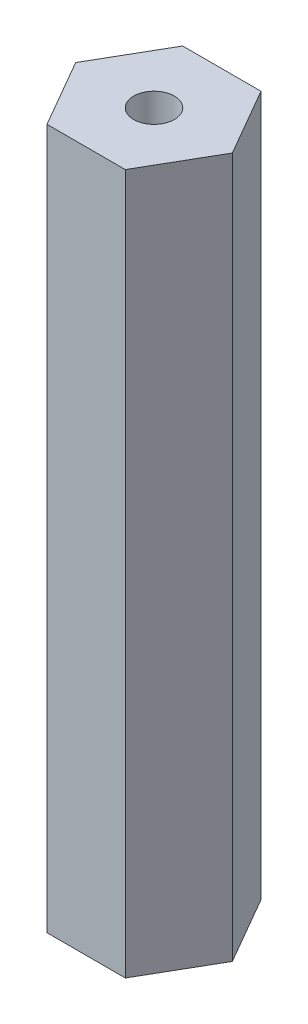
ISO-10303-21;
HEADER;
FILE_DESCRIPTION(('STEP AP214'),'2;1');
FILE_NAME('part.step','',(''),(''),'','','');
FILE_SCHEMA(('AUTOMOTIVE_DESIGN { 1 0 10303 214 1 1 1 1 }'));
ENDSEC;
DATA;
#1=APPLICATION_CONTEXT('core data for automotive mechanical design processes');
#2=APPLICATION_PROTOCOL_DEFINITION('international standard','automotive_design',2000,#1);
#3=PRODUCT_CONTEXT('',#1,'mechanical');
#4=PRODUCT('Part','Part','',(#3));
#5=PRODUCT_RELATED_PRODUCT_CATEGORY('part','',(#4));
#6=PRODUCT_DEFINITION_FORMATION('','',#4);
#7=PRODUCT_DEFINITION_CONTEXT('part definition',#1,'design');
#8=PRODUCT_DEFINITION('design','',#6,#7);
#9=PRODUCT_DEFINITION_SHAPE('','',#8);
#10=(LENGTH_UNIT() NAMED_UNIT(*) SI_UNIT(.MILLI.,.METRE.));
#11=(NAMED_UNIT(*) PLANE_ANGLE_UNIT() SI_UNIT($,.RADIAN.));
#12=(NAMED_UNIT(*) SI_UNIT($,.STERADIAN.) SOLID_ANGLE_UNIT());
#13=UNCERTAINTY_MEASURE_WITH_UNIT(LENGTH_MEASURE(1.E-05),#10,'distance_accuracy_value','');
#14=(GEOMETRIC_REPRESENTATION_CONTEXT(3) GLOBAL_UNCERTAINTY_ASSIGNED_CONTEXT((#13)) GLOBAL_UNIT_ASSIGNED_CONTEXT((#10,
#11,#12)) REPRESENTATION_CONTEXT('',''));
#15=CARTESIAN_POINT('',(0.,0.,0.));
#16=DIRECTION('',(0.,0.,1.));
#17=DIRECTION('',(1.,0.,0.));
#18=AXIS2_PLACEMENT_3D('',#15,#16,#17);
#19=CARTESIAN_POINT('',(0.,0.,0.));
#20=DIRECTION('',(0.,1.,0.));
#21=DIRECTION('',(0.,0.,1.));
#22=AXIS2_PLACEMENT_3D('',#19,#20,#21);
#23=PLANE('',#22);
#24=CARTESIAN_POINT('',(0.,0.,0.));
#25=DIRECTION('',(0.,1.,0.));
#26=DIRECTION('',(0.,0.,1.));
#27=AXIS2_PLACEMENT_3D('',#24,#25,#26);
#28=CIRCLE('',#27,0.75);
#29=CARTESIAN_POINT('',(0.,0.,0.75));
#30=VERTEX_POINT('',#29);
#31=EDGE_CURVE('E106',#30,#30,#28,.T.);
#32=ORIENTED_EDGE('',*,*,#31,.T.);
#33=EDGE_LOOP('',(#32));
#34=FACE_BOUND('',#33,.T.);
#35=DIRECTION('',(0.499999999999995,0.,-0.866025403784442));
#36=VECTOR('',#35,1.);
#37=CARTESIAN_POINT('',(1.44337567297409,0.,2.49999999999997));
#38=LINE('',#37,#36);
#39=CARTESIAN_POINT('',(1.44337567297409,0.,2.49999999999997));
#40=VERTEX_POINT('',#39);
#41=CARTESIAN_POINT('',(2.88675134594812,0.,0.));
#42=VERTEX_POINT('',#41);
#43=EDGE_CURVE('E98',#40,#42,#38,.T.);
#44=ORIENTED_EDGE('',*,*,#43,.F.);
#45=DIRECTION('',(1.,0.,0.));
#46=VECTOR('',#45,1.);
#47=CARTESIAN_POINT('',(-1.44337567297404,0.,2.5));
#48=LINE('',#47,#46);
#49=CARTESIAN_POINT('',(-1.44337567297404,0.,2.5));
#50=VERTEX_POINT('',#49);
#51=EDGE_CURVE('E120',#50,#40,#48,.T.);
#52=ORIENTED_EDGE('',*,*,#51,.F.);
#53=DIRECTION('',(0.500000000000007,0.,0.866025403784435));
#54=VECTOR('',#53,1.);
#55=CARTESIAN_POINT('',(-2.88675134594812,0.,0.));
#56=LINE('',#55,#54);
#57=CARTESIAN_POINT('',(-2.88675134594812,0.,0.));
#58=VERTEX_POINT('',#57);
#59=EDGE_CURVE('E117',#58,#50,#56,.T.);
#60=ORIENTED_EDGE('',*,*,#59,.F.);
#61=DIRECTION('',(-0.499999999999995,0.,0.866025403784441));
#62=VECTOR('',#61,1.);
#63=CARTESIAN_POINT('',(-1.44337567297407,0.,-2.49999999999998));
#64=LINE('',#63,#62);
#65=CARTESIAN_POINT('',(-1.44337567297407,0.,-2.49999999999998));
#66=VERTEX_POINT('',#65);
#67=EDGE_CURVE('E114',#66,#58,#64,.T.);
#68=ORIENTED_EDGE('',*,*,#67,.F.);
#69=DIRECTION('',(-1.,0.,0.));
#70=VECTOR('',#69,1.);
#71=CARTESIAN_POINT('',(1.44337567297405,0.,-2.49999999999999));
#72=LINE('',#71,#70);
#73=CARTESIAN_POINT('',(1.44337567297405,0.,-2.49999999999999));
#74=VERTEX_POINT('',#73);
#75=EDGE_CURVE('E101',#74,#66,#72,.T.);
#76=ORIENTED_EDGE('',*,*,#75,.F.);
#77=DIRECTION('',(-0.500000000000001,0.,-0.866025403784438));
#78=VECTOR('',#77,1.);
#79=CARTESIAN_POINT('',(2.88675134594812,0.,0.));
#80=LINE('',#79,#78);
#81=EDGE_CURVE('E90',#42,#74,#80,.T.);
#82=ORIENTED_EDGE('',*,*,#81,.F.);
#83=EDGE_LOOP('',(#44,#52,#60,#68,#76,#82));
#84=FACE_BOUND('',#83,.T.);
#85=ADVANCED_FACE('F34',(#34,#84),#23,.F.);
#86=CARTESIAN_POINT('',(-1.44337567297404,33.4376261582597,2.5));
#87=DIRECTION('',(0.,0.,-1.));
#88=DIRECTION('',(-1.,0.,0.));
#89=AXIS2_PLACEMENT_3D('',#86,#87,#88);
#90=PLANE('',#89);
#91=DIRECTION('',(0.,-1.,0.));
#92=VECTOR('',#91,1.);
#93=CARTESIAN_POINT('',(1.44337567297409,33.4376261582597,2.49999999999997));
#94=LINE('',#93,#92);
#95=CARTESIAN_POINT('',(1.44337567297409,25.8,2.49999999999997));
#96=VERTEX_POINT('',#95);
#97=EDGE_CURVE('E104',#96,#40,#94,.T.);
#98=ORIENTED_EDGE('',*,*,#97,.F.);
#99=DIRECTION('',(-1.,0.,0.));
#100=VECTOR('',#99,1.);
#101=CARTESIAN_POINT('',(-1.44337567297404,25.8,2.5));
#102=LINE('',#101,#100);
#103=CARTESIAN_POINT('',(-1.44337567297404,25.8,2.5));
#104=VERTEX_POINT('',#103);
#105=EDGE_CURVE('E38',#96,#104,#102,.T.);
#106=ORIENTED_EDGE('',*,*,#105,.T.);
#107=DIRECTION('',(0.,-1.,0.));
#108=VECTOR('',#107,1.);
#109=CARTESIAN_POINT('',(-1.44337567297404,33.4376261582597,2.5));
#110=LINE('',#109,#108);
#111=EDGE_CURVE('E123',#104,#50,#110,.T.);
#112=ORIENTED_EDGE('',*,*,#111,.T.);
#113=ORIENTED_EDGE('',*,*,#51,.T.);
#114=EDGE_LOOP('',(#98,#106,#112,#113));
#115=FACE_BOUND('',#114,.T.);
#116=ADVANCED_FACE('F155',(#115),#90,.F.);
#117=CARTESIAN_POINT('',(-2.88675134594812,33.4376261582597,0.));
#118=DIRECTION('',(0.866025403784435,0.,-0.500000000000007));
#119=DIRECTION('',(-0.500000000000007,0.,-0.866025403784434));
#120=AXIS2_PLACEMENT_3D('',#117,#118,#119);
#121=PLANE('',#120);
#122=ORIENTED_EDGE('',*,*,#111,.F.);
#123=DIRECTION('',(-0.500000000000007,0.,-0.866025403784434));
#124=VECTOR('',#123,1.);
#125=CARTESIAN_POINT('',(-2.88675134594812,25.8,0.));
#126=LINE('',#125,#124);
#127=CARTESIAN_POINT('',(-2.88675134594812,25.8,0.));
#128=VERTEX_POINT('',#127);
#129=EDGE_CURVE('E134',#104,#128,#126,.T.);
#130=ORIENTED_EDGE('',*,*,#129,.T.);
#131=DIRECTION('',(0.,-1.,0.));
#132=VECTOR('',#131,1.);
#133=CARTESIAN_POINT('',(-2.88675134594812,33.4376261582597,0.));
#134=LINE('',#133,#132);
#135=EDGE_CURVE('E125',#128,#58,#134,.T.);
#136=ORIENTED_EDGE('',*,*,#135,.T.);
#137=ORIENTED_EDGE('',*,*,#59,.T.);
#138=EDGE_LOOP('',(#122,#130,#136,#137));
#139=FACE_BOUND('',#138,.T.);
#140=ADVANCED_FACE('F160',(#139),#121,.F.);
#141=CARTESIAN_POINT('',(-1.44337567297407,33.4376261582597,-2.49999999999998));
#142=DIRECTION('',(0.866025403784441,0.,0.499999999999995));
#143=DIRECTION('',(0.499999999999995,0.,-0.866025403784442));
#144=AXIS2_PLACEMENT_3D('',#141,#142,#143);
#145=PLANE('',#144);
#146=ORIENTED_EDGE('',*,*,#135,.F.);
#147=DIRECTION('',(0.499999999999995,0.,-0.866025403784442));
#148=VECTOR('',#147,1.);
#149=CARTESIAN_POINT('',(-1.44337567297407,25.8,-2.49999999999998));
#150=LINE('',#149,#148);
#151=CARTESIAN_POINT('',(-1.44337567297407,25.8,-2.49999999999998));
#152=VERTEX_POINT('',#151);
#153=EDGE_CURVE('E132',#128,#152,#150,.T.);
#154=ORIENTED_EDGE('',*,*,#153,.T.);
#155=DIRECTION('',(0.,-1.,0.));
#156=VECTOR('',#155,1.);
#157=CARTESIAN_POINT('',(-1.44337567297407,33.4376261582597,-2.49999999999998));
#158=LINE('',#157,#156);
#159=EDGE_CURVE('E127',#152,#66,#158,.T.);
#160=ORIENTED_EDGE('',*,*,#159,.T.);
#161=ORIENTED_EDGE('',*,*,#67,.T.);
#162=EDGE_LOOP('',(#146,#154,#160,#161));
#163=FACE_BOUND('',#162,.T.);
#164=ADVANCED_FACE('F166',(#163),#145,.F.);
#165=CARTESIAN_POINT('',(1.44337567297405,33.4376261582597,-2.49999999999999));
#166=DIRECTION('',(0.,0.,1.));
#167=DIRECTION('',(1.,0.,0.));
#168=AXIS2_PLACEMENT_3D('',#165,#166,#167);
#169=PLANE('',#168);
#170=ORIENTED_EDGE('',*,*,#159,.F.);
#171=DIRECTION('',(1.,0.,0.));
#172=VECTOR('',#171,1.);
#173=CARTESIAN_POINT('',(1.44337567297405,25.8,-2.49999999999999));
#174=LINE('',#173,#172);
#175=CARTESIAN_POINT('',(1.44337567297405,25.8,-2.49999999999999));
#176=VERTEX_POINT('',#175);
#177=EDGE_CURVE('E55',#152,#176,#174,.T.);
#178=ORIENTED_EDGE('',*,*,#177,.T.);
#179=DIRECTION('',(0.,-1.,0.));
#180=VECTOR('',#179,1.);
#181=CARTESIAN_POINT('',(1.44337567297405,33.4376261582597,-2.49999999999999));
#182=LINE('',#181,#180);
#183=EDGE_CURVE('E94',#176,#74,#182,.T.);
#184=ORIENTED_EDGE('',*,*,#183,.T.);
#185=ORIENTED_EDGE('',*,*,#75,.T.);
#186=EDGE_LOOP('',(#170,#178,#184,#185));
#187=FACE_BOUND('',#186,.T.);
#188=ADVANCED_FACE('F130',(#187),#169,.F.);
#189=CARTESIAN_POINT('',(2.88675134594812,33.4376261582597,0.));
#190=DIRECTION('',(-0.866025403784438,0.,0.500000000000001));
#191=DIRECTION('',(0.500000000000001,0.,0.866025403784438));
#192=AXIS2_PLACEMENT_3D('',#189,#190,#191);
#193=PLANE('',#192);
#194=ORIENTED_EDGE('',*,*,#183,.F.);
#195=DIRECTION('',(0.500000000000001,0.,0.866025403784438));
#196=VECTOR('',#195,1.);
#197=CARTESIAN_POINT('',(2.88675134594812,25.8,0.));
#198=LINE('',#197,#196);
#199=CARTESIAN_POINT('',(2.88675134594812,25.8,0.));
#200=VERTEX_POINT('',#199);
#201=EDGE_CURVE('E43',#176,#200,#198,.T.);
#202=ORIENTED_EDGE('',*,*,#201,.T.);
#203=DIRECTION('',(0.,-1.,0.));
#204=VECTOR('',#203,1.);
#205=CARTESIAN_POINT('',(2.88675134594812,33.4376261582597,0.));
#206=LINE('',#205,#204);
#207=EDGE_CURVE('E87',#200,#42,#206,.T.);
#208=ORIENTED_EDGE('',*,*,#207,.T.);
#209=ORIENTED_EDGE('',*,*,#81,.T.);
#210=EDGE_LOOP('',(#194,#202,#208,#209));
#211=FACE_BOUND('',#210,.T.);
#212=ADVANCED_FACE('F89',(#211),#193,.F.);
#213=CARTESIAN_POINT('',(1.44337567297409,33.4376261582597,2.49999999999997));
#214=DIRECTION('',(-0.866025403784442,0.,-0.499999999999995));
#215=DIRECTION('',(-0.499999999999995,0.,0.866025403784442));
#216=AXIS2_PLACEMENT_3D('',#213,#214,#215);
#217=PLANE('',#216);
#218=ORIENTED_EDGE('',*,*,#207,.F.);
#219=DIRECTION('',(-0.499999999999995,0.,0.866025403784442));
#220=VECTOR('',#219,1.);
#221=CARTESIAN_POINT('',(1.44337567297409,25.8,2.49999999999997));
#222=LINE('',#221,#220);
#223=EDGE_CURVE('E11',#200,#96,#222,.T.);
#224=ORIENTED_EDGE('',*,*,#223,.T.);
#225=ORIENTED_EDGE('',*,*,#97,.T.);
#226=ORIENTED_EDGE('',*,*,#43,.T.);
#227=EDGE_LOOP('',(#218,#224,#225,#226));
#228=FACE_BOUND('',#227,.T.);
#229=ADVANCED_FACE('F36',(#228),#217,.F.);
#230=CARTESIAN_POINT('',(-3.0693995,25.8,73.06799966));
#231=DIRECTION('',(0.,-1.,0.));
#232=DIRECTION('',(1.,0.,0.));
#233=AXIS2_PLACEMENT_3D('',#230,#231,#232);
#234=PLANE('',#233);
#235=CARTESIAN_POINT('',(0.,25.8,0.));
#236=DIRECTION('',(0.,1.,0.));
#237=DIRECTION('',(0.,0.,1.));
#238=AXIS2_PLACEMENT_3D('',#235,#236,#237);
#239=CIRCLE('',#238,0.75);
#240=CARTESIAN_POINT('',(0.,25.8,0.75));
#241=VERTEX_POINT('',#240);
#242=EDGE_CURVE('E109',#241,#241,#239,.T.);
#243=ORIENTED_EDGE('',*,*,#242,.F.);
#244=EDGE_LOOP('',(#243));
#245=FACE_BOUND('',#244,.T.);
#246=ORIENTED_EDGE('',*,*,#201,.F.);
#247=ORIENTED_EDGE('',*,*,#177,.F.);
#248=ORIENTED_EDGE('',*,*,#153,.F.);
#249=ORIENTED_EDGE('',*,*,#129,.F.);
#250=ORIENTED_EDGE('',*,*,#105,.F.);
#251=ORIENTED_EDGE('',*,*,#223,.F.);
#252=EDGE_LOOP('',(#246,#247,#248,#249,#250,#251));
#253=FACE_BOUND('',#252,.T.);
#254=ADVANCED_FACE('F144',(#245,#253),#234,.F.);
#255=CARTESIAN_POINT('',(0.,0.,0.));
#256=DIRECTION('',(0.,1.,0.));
#257=DIRECTION('',(0.,0.,1.));
#258=AXIS2_PLACEMENT_3D('',#255,#256,#257);
#259=CYLINDRICAL_SURFACE('',#258,0.75);
#260=ORIENTED_EDGE('',*,*,#31,.F.);
#261=EDGE_LOOP('',(#260));
#262=FACE_BOUND('',#261,.T.);
#263=ORIENTED_EDGE('',*,*,#242,.T.);
#264=EDGE_LOOP('',(#263));
#265=FACE_BOUND('',#264,.T.);
#266=ADVANCED_FACE('F142',(#262,#265),#259,.F.);
#267=CLOSED_SHELL('',(#85,#116,#140,#164,#188,#212,#229,#254,#266));
#268=MANIFOLD_SOLID_BREP('B2',#267);
#269=ADVANCED_BREP_SHAPE_REPRESENTATION('',(#18,#268),#14);
#270=SHAPE_DEFINITION_REPRESENTATION(#9,#269);
ENDSEC;
END-ISO-10303-21;
